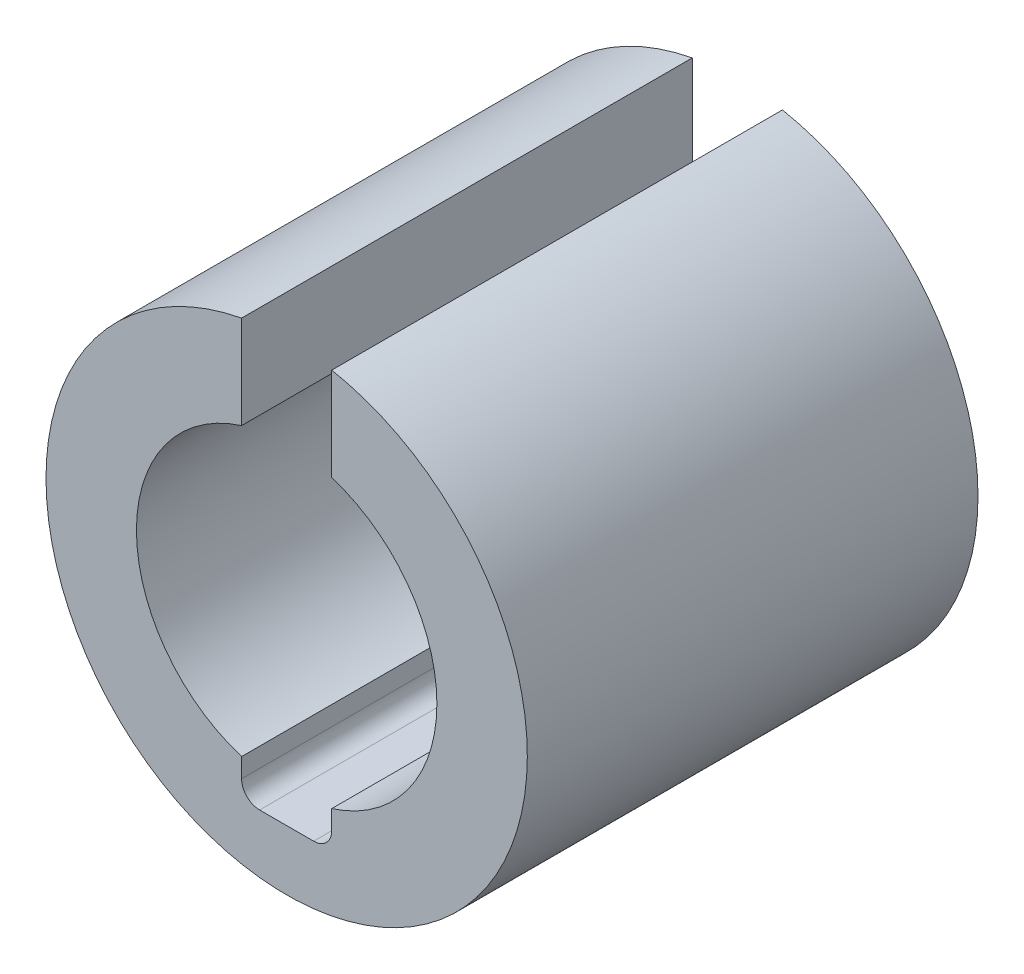
ISO-10303-21;
HEADER;
FILE_DESCRIPTION(('STEP AP214'),'2;1');
FILE_NAME('part.step','',(''),(''),'','','');
FILE_SCHEMA(('AUTOMOTIVE_DESIGN { 1 0 10303 214 1 1 1 1 }'));
ENDSEC;
DATA;
#1=APPLICATION_CONTEXT('core data for automotive mechanical design processes');
#2=APPLICATION_PROTOCOL_DEFINITION('international standard','automotive_design',2000,#1);
#3=PRODUCT_CONTEXT('',#1,'mechanical');
#4=PRODUCT('Part','Part','',(#3));
#5=PRODUCT_RELATED_PRODUCT_CATEGORY('part','',(#4));
#6=PRODUCT_DEFINITION_FORMATION('','',#4);
#7=PRODUCT_DEFINITION_CONTEXT('part definition',#1,'design');
#8=PRODUCT_DEFINITION('design','',#6,#7);
#9=PRODUCT_DEFINITION_SHAPE('','',#8);
#10=(LENGTH_UNIT() NAMED_UNIT(*) SI_UNIT(.MILLI.,.METRE.));
#11=(NAMED_UNIT(*) PLANE_ANGLE_UNIT() SI_UNIT($,.RADIAN.));
#12=(NAMED_UNIT(*) SI_UNIT($,.STERADIAN.) SOLID_ANGLE_UNIT());
#13=UNCERTAINTY_MEASURE_WITH_UNIT(LENGTH_MEASURE(1.E-05),#10,'distance_accuracy_value','');
#14=(GEOMETRIC_REPRESENTATION_CONTEXT(3) GLOBAL_UNCERTAINTY_ASSIGNED_CONTEXT((#13)) GLOBAL_UNIT_ASSIGNED_CONTEXT((#10,
#11,#12)) REPRESENTATION_CONTEXT('',''));
#15=CARTESIAN_POINT('',(0.,0.,0.));
#16=DIRECTION('',(0.,0.,1.));
#17=DIRECTION('',(1.,0.,0.));
#18=AXIS2_PLACEMENT_3D('',#15,#16,#17);
#19=CARTESIAN_POINT('',(-0.750000000000001,-3.005,3.75));
#20=DIRECTION('',(0.,-1.,0.));
#21=DIRECTION('',(0.,0.,-1.));
#22=AXIS2_PLACEMENT_3D('',#19,#20,#21);
#23=PLANE('',#22);
#24=DIRECTION('',(0.,0.,1.));
#25=VECTOR('',#24,1.);
#26=CARTESIAN_POINT('',(-0.450000000000001,-3.005,3.75));
#27=LINE('',#26,#25);
#28=CARTESIAN_POINT('',(-0.450000000000001,-3.005,-3.75));
#29=VERTEX_POINT('',#28);
#30=CARTESIAN_POINT('',(-0.450000000000001,-3.005,3.75));
#31=VERTEX_POINT('',#30);
#32=EDGE_CURVE('E111',#29,#31,#27,.T.);
#33=ORIENTED_EDGE('',*,*,#32,.T.);
#34=DIRECTION('',(1.,0.,0.));
#35=VECTOR('',#34,1.);
#36=CARTESIAN_POINT('',(-0.750000000000001,-3.005,3.75));
#37=LINE('',#36,#35);
#38=CARTESIAN_POINT('',(0.45,-3.005,3.75));
#39=VERTEX_POINT('',#38);
#40=EDGE_CURVE('E127',#39,#31,#37,.F.);
#41=ORIENTED_EDGE('',*,*,#40,.F.);
#42=DIRECTION('',(0.,0.,1.));
#43=VECTOR('',#42,1.);
#44=CARTESIAN_POINT('',(0.45,-3.005,3.75));
#45=LINE('',#44,#43);
#46=CARTESIAN_POINT('',(0.45,-3.005,-3.75));
#47=VERTEX_POINT('',#46);
#48=EDGE_CURVE('E122',#39,#47,#45,.F.);
#49=ORIENTED_EDGE('',*,*,#48,.T.);
#50=DIRECTION('',(1.,0.,0.));
#51=VECTOR('',#50,1.);
#52=CARTESIAN_POINT('',(-0.750000000000001,-3.005,-3.75));
#53=LINE('',#52,#51);
#54=EDGE_CURVE('E112',#29,#47,#53,.T.);
#55=ORIENTED_EDGE('',*,*,#54,.F.);
#56=EDGE_LOOP('',(#33,#41,#49,#55));
#57=FACE_BOUND('',#56,.T.);
#58=ADVANCED_FACE('F17',(#57),#23,.F.);
#59=CARTESIAN_POINT('',(-0.450000000000001,-2.705,3.75));
#60=DIRECTION('',(0.,0.,1.));
#61=DIRECTION('',(1.,0.,0.));
#62=AXIS2_PLACEMENT_3D('',#59,#60,#61);
#63=CYLINDRICAL_SURFACE('',#62,0.3);
#64=ORIENTED_EDGE('',*,*,#32,.F.);
#65=CARTESIAN_POINT('',(-0.450000000000001,-2.705,-3.75));
#66=DIRECTION('',(0.,0.,1.));
#67=DIRECTION('',(1.,0.,0.));
#68=AXIS2_PLACEMENT_3D('',#65,#66,#67);
#69=CIRCLE('',#68,0.3);
#70=CARTESIAN_POINT('',(-0.75,-2.705,-3.75));
#71=VERTEX_POINT('',#70);
#72=EDGE_CURVE('E20',#71,#29,#69,.T.);
#73=ORIENTED_EDGE('',*,*,#72,.F.);
#74=DIRECTION('',(0.,0.,1.));
#75=VECTOR('',#74,1.);
#76=CARTESIAN_POINT('',(-0.750000000000001,-2.705,3.75));
#77=LINE('',#76,#75);
#78=CARTESIAN_POINT('',(-0.75,-2.705,3.75));
#79=VERTEX_POINT('',#78);
#80=EDGE_CURVE('E101',#71,#79,#77,.T.);
#81=ORIENTED_EDGE('',*,*,#80,.T.);
#82=CARTESIAN_POINT('',(-0.450000000000001,-2.705,3.75));
#83=DIRECTION('',(0.,0.,1.));
#84=DIRECTION('',(1.,0.,0.));
#85=AXIS2_PLACEMENT_3D('',#82,#83,#84);
#86=CIRCLE('',#85,0.3);
#87=EDGE_CURVE('E126',#31,#79,#86,.F.);
#88=ORIENTED_EDGE('',*,*,#87,.F.);
#89=EDGE_LOOP('',(#64,#73,#81,#88));
#90=FACE_BOUND('',#89,.T.);
#91=ADVANCED_FACE('F107',(#90),#63,.F.);
#92=CARTESIAN_POINT('',(0.450000000000001,-2.705,3.75));
#93=DIRECTION('',(0.,0.,1.));
#94=DIRECTION('',(1.,0.,0.));
#95=AXIS2_PLACEMENT_3D('',#92,#93,#94);
#96=CYLINDRICAL_SURFACE('',#95,0.3);
#97=DIRECTION('',(0.,0.,1.));
#98=VECTOR('',#97,1.);
#99=CARTESIAN_POINT('',(0.750000000000001,-2.705,3.75));
#100=LINE('',#99,#98);
#101=CARTESIAN_POINT('',(0.75,-2.705,3.75));
#102=VERTEX_POINT('',#101);
#103=CARTESIAN_POINT('',(0.75,-2.705,-3.75));
#104=VERTEX_POINT('',#103);
#105=EDGE_CURVE('E121',#102,#104,#100,.F.);
#106=ORIENTED_EDGE('',*,*,#105,.T.);
#107=CARTESIAN_POINT('',(0.450000000000001,-2.705,-3.75));
#108=DIRECTION('',(0.,0.,1.));
#109=DIRECTION('',(1.,0.,0.));
#110=AXIS2_PLACEMENT_3D('',#107,#108,#109);
#111=CIRCLE('',#110,0.3);
#112=EDGE_CURVE('E125',#47,#104,#111,.T.);
#113=ORIENTED_EDGE('',*,*,#112,.F.);
#114=ORIENTED_EDGE('',*,*,#48,.F.);
#115=CARTESIAN_POINT('',(0.450000000000001,-2.705,3.75));
#116=DIRECTION('',(0.,0.,1.));
#117=DIRECTION('',(1.,0.,0.));
#118=AXIS2_PLACEMENT_3D('',#115,#116,#117);
#119=CIRCLE('',#118,0.3);
#120=EDGE_CURVE('E102',#102,#39,#119,.F.);
#121=ORIENTED_EDGE('',*,*,#120,.F.);
#122=EDGE_LOOP('',(#106,#113,#114,#121));
#123=FACE_BOUND('',#122,.T.);
#124=ADVANCED_FACE('F160',(#123),#96,.F.);
#125=CARTESIAN_POINT('',(-0.750000000000001,-3.005,3.75));
#126=DIRECTION('',(-1.,0.,0.));
#127=DIRECTION('',(0.,-1.,0.));
#128=AXIS2_PLACEMENT_3D('',#125,#126,#127);
#129=PLANE('',#128);
#130=ORIENTED_EDGE('',*,*,#80,.F.);
#131=DIRECTION('',(0.,-1.,0.));
#132=VECTOR('',#131,1.);
#133=CARTESIAN_POINT('',(-0.750000000000001,-3.005,-3.75));
#134=LINE('',#133,#132);
#135=CARTESIAN_POINT('',(-0.75,-2.38484800354236,-3.75));
#136=VERTEX_POINT('',#135);
#137=EDGE_CURVE('E91',#136,#71,#134,.T.);
#138=ORIENTED_EDGE('',*,*,#137,.F.);
#139=DIRECTION('',(0.,0.,-1.));
#140=VECTOR('',#139,1.);
#141=CARTESIAN_POINT('',(-0.75,-2.38484800354236,3.75));
#142=LINE('',#141,#140);
#143=CARTESIAN_POINT('',(-0.75,-2.38484800354236,3.75));
#144=VERTEX_POINT('',#143);
#145=EDGE_CURVE('E173',#136,#144,#142,.F.);
#146=ORIENTED_EDGE('',*,*,#145,.T.);
#147=DIRECTION('',(0.,-1.,0.));
#148=VECTOR('',#147,1.);
#149=CARTESIAN_POINT('',(-0.750000000000001,-3.005,3.75));
#150=LINE('',#149,#148);
#151=EDGE_CURVE('E115',#79,#144,#150,.F.);
#152=ORIENTED_EDGE('',*,*,#151,.F.);
#153=EDGE_LOOP('',(#130,#138,#146,#152));
#154=FACE_BOUND('',#153,.T.);
#155=ADVANCED_FACE('F113',(#154),#129,.F.);
#156=CARTESIAN_POINT('',(0.75,-2.38484800354236,3.75));
#157=DIRECTION('',(1.,0.,0.));
#158=DIRECTION('',(0.,1.,0.));
#159=AXIS2_PLACEMENT_3D('',#156,#157,#158);
#160=PLANE('',#159);
#161=ORIENTED_EDGE('',*,*,#105,.F.);
#162=DIRECTION('',(0.,1.,0.));
#163=VECTOR('',#162,1.);
#164=CARTESIAN_POINT('',(0.75,-2.38484800354236,3.75));
#165=LINE('',#164,#163);
#166=CARTESIAN_POINT('',(0.75,-2.38484800354236,3.75));
#167=VERTEX_POINT('',#166);
#168=EDGE_CURVE('E117',#167,#102,#165,.F.);
#169=ORIENTED_EDGE('',*,*,#168,.F.);
#170=DIRECTION('',(0.,0.,-1.));
#171=VECTOR('',#170,1.);
#172=CARTESIAN_POINT('',(0.750000000000001,-2.38484800354236,3.75));
#173=LINE('',#172,#171);
#174=CARTESIAN_POINT('',(0.75,-2.38484800354236,-3.75));
#175=VERTEX_POINT('',#174);
#176=EDGE_CURVE('E164',#167,#175,#173,.T.);
#177=ORIENTED_EDGE('',*,*,#176,.T.);
#178=DIRECTION('',(0.,1.,0.));
#179=VECTOR('',#178,1.);
#180=CARTESIAN_POINT('',(0.75,-2.38484800354236,-3.75));
#181=LINE('',#180,#179);
#182=EDGE_CURVE('E156',#104,#175,#181,.T.);
#183=ORIENTED_EDGE('',*,*,#182,.F.);
#184=EDGE_LOOP('',(#161,#169,#177,#183));
#185=FACE_BOUND('',#184,.T.);
#186=ADVANCED_FACE('F162',(#185),#160,.F.);
#187=CARTESIAN_POINT('',(0.75,3.9341485737069,3.75));
#188=DIRECTION('',(1.,0.,0.));
#189=DIRECTION('',(0.,1.,0.));
#190=AXIS2_PLACEMENT_3D('',#187,#188,#189);
#191=PLANE('',#190);
#192=DIRECTION('',(0.,0.,-1.));
#193=VECTOR('',#192,1.);
#194=CARTESIAN_POINT('',(0.75,2.38484800354236,3.75));
#195=LINE('',#194,#193);
#196=CARTESIAN_POINT('',(0.75,2.38484800354236,-3.75));
#197=VERTEX_POINT('',#196);
#198=CARTESIAN_POINT('',(0.75,2.38484800354236,3.75));
#199=VERTEX_POINT('',#198);
#200=EDGE_CURVE('E178',#197,#199,#195,.F.);
#201=ORIENTED_EDGE('',*,*,#200,.T.);
#202=DIRECTION('',(0.,1.,0.));
#203=VECTOR('',#202,1.);
#204=CARTESIAN_POINT('',(0.75,3.9341485737069,3.75));
#205=LINE('',#204,#203);
#206=CARTESIAN_POINT('',(0.75,3.9341485737069,3.75));
#207=VERTEX_POINT('',#206);
#208=EDGE_CURVE('E165',#207,#199,#205,.F.);
#209=ORIENTED_EDGE('',*,*,#208,.F.);
#210=DIRECTION('',(0.,0.,-1.));
#211=VECTOR('',#210,1.);
#212=CARTESIAN_POINT('',(0.75,3.9341485737069,3.75));
#213=LINE('',#212,#211);
#214=CARTESIAN_POINT('',(0.75,3.9341485737069,-3.75));
#215=VERTEX_POINT('',#214);
#216=EDGE_CURVE('E144',#215,#207,#213,.F.);
#217=ORIENTED_EDGE('',*,*,#216,.F.);
#218=DIRECTION('',(0.,1.,0.));
#219=VECTOR('',#218,1.);
#220=CARTESIAN_POINT('',(0.75,3.9341485737069,-3.75));
#221=LINE('',#220,#219);
#222=EDGE_CURVE('E35',#197,#215,#221,.T.);
#223=ORIENTED_EDGE('',*,*,#222,.F.);
#224=EDGE_LOOP('',(#201,#209,#217,#223));
#225=FACE_BOUND('',#224,.T.);
#226=ADVANCED_FACE('F194',(#225),#191,.F.);
#227=CARTESIAN_POINT('',(-0.75,2.38484800354236,3.75));
#228=DIRECTION('',(-1.,0.,0.));
#229=DIRECTION('',(0.,-1.,0.));
#230=AXIS2_PLACEMENT_3D('',#227,#228,#229);
#231=PLANE('',#230);
#232=DIRECTION('',(0.,0.,-1.));
#233=VECTOR('',#232,1.);
#234=CARTESIAN_POINT('',(-0.75,3.9341485737069,3.75));
#235=LINE('',#234,#233);
#236=CARTESIAN_POINT('',(-0.75,3.9341485737069,3.75));
#237=VERTEX_POINT('',#236);
#238=CARTESIAN_POINT('',(-0.75,3.9341485737069,-3.75));
#239=VERTEX_POINT('',#238);
#240=EDGE_CURVE('E136',#237,#239,#235,.T.);
#241=ORIENTED_EDGE('',*,*,#240,.F.);
#242=DIRECTION('',(0.,1.,0.));
#243=VECTOR('',#242,1.);
#244=CARTESIAN_POINT('',(-0.75,0.,3.75));
#245=LINE('',#244,#243);
#246=CARTESIAN_POINT('',(-0.75,2.38484800354236,3.75));
#247=VERTEX_POINT('',#246);
#248=EDGE_CURVE('E140',#247,#237,#245,.T.);
#249=ORIENTED_EDGE('',*,*,#248,.F.);
#250=DIRECTION('',(0.,0.,-1.));
#251=VECTOR('',#250,1.);
#252=CARTESIAN_POINT('',(-0.75,2.38484800354236,3.75));
#253=LINE('',#252,#251);
#254=CARTESIAN_POINT('',(-0.75,2.38484800354236,-3.75));
#255=VERTEX_POINT('',#254);
#256=EDGE_CURVE('E175',#247,#255,#253,.T.);
#257=ORIENTED_EDGE('',*,*,#256,.T.);
#258=DIRECTION('',(0.,-1.,0.));
#259=VECTOR('',#258,1.);
#260=CARTESIAN_POINT('',(-0.75,2.38484800354236,-3.75));
#261=LINE('',#260,#259);
#262=EDGE_CURVE('E171',#239,#255,#261,.T.);
#263=ORIENTED_EDGE('',*,*,#262,.F.);
#264=EDGE_LOOP('',(#241,#249,#257,#263));
#265=FACE_BOUND('',#264,.T.);
#266=ADVANCED_FACE('F191',(#265),#231,.F.);
#267=CARTESIAN_POINT('',(0.,0.,3.75));
#268=DIRECTION('',(0.,0.,-1.));
#269=DIRECTION('',(-1.,0.,0.));
#270=AXIS2_PLACEMENT_3D('',#267,#268,#269);
#271=CYLINDRICAL_SURFACE('',#270,2.5);
#272=CARTESIAN_POINT('',(0.,0.,3.75));
#273=DIRECTION('',(0.,0.,-1.));
#274=DIRECTION('',(-1.,0.,0.));
#275=AXIS2_PLACEMENT_3D('',#272,#273,#274);
#276=CIRCLE('',#275,2.5);
#277=EDGE_CURVE('E137',#144,#247,#276,.T.);
#278=ORIENTED_EDGE('',*,*,#277,.F.);
#279=ORIENTED_EDGE('',*,*,#145,.F.);
#280=CARTESIAN_POINT('',(0.,0.,-3.75));
#281=DIRECTION('',(0.,0.,-1.));
#282=DIRECTION('',(-1.,0.,0.));
#283=AXIS2_PLACEMENT_3D('',#280,#281,#282);
#284=CIRCLE('',#283,2.5);
#285=EDGE_CURVE('E96',#136,#255,#284,.T.);
#286=ORIENTED_EDGE('',*,*,#285,.T.);
#287=ORIENTED_EDGE('',*,*,#256,.F.);
#288=EDGE_LOOP('',(#278,#279,#286,#287));
#289=FACE_BOUND('',#288,.T.);
#290=ADVANCED_FACE('F199',(#289),#271,.F.);
#291=CARTESIAN_POINT('',(0.,0.,3.75));
#292=DIRECTION('',(0.,0.,-1.));
#293=DIRECTION('',(-1.,0.,0.));
#294=AXIS2_PLACEMENT_3D('',#291,#292,#293);
#295=CYLINDRICAL_SURFACE('',#294,2.5);
#296=ORIENTED_EDGE('',*,*,#176,.F.);
#297=CARTESIAN_POINT('',(0.,0.,3.75));
#298=DIRECTION('',(0.,0.,-1.));
#299=DIRECTION('',(-1.,0.,0.));
#300=AXIS2_PLACEMENT_3D('',#297,#298,#299);
#301=CIRCLE('',#300,2.5);
#302=EDGE_CURVE('E141',#199,#167,#301,.T.);
#303=ORIENTED_EDGE('',*,*,#302,.F.);
#304=ORIENTED_EDGE('',*,*,#200,.F.);
#305=CARTESIAN_POINT('',(0.,0.,-3.75));
#306=DIRECTION('',(0.,0.,-1.));
#307=DIRECTION('',(-1.,0.,0.));
#308=AXIS2_PLACEMENT_3D('',#305,#306,#307);
#309=CIRCLE('',#308,2.5);
#310=EDGE_CURVE('E132',#197,#175,#309,.T.);
#311=ORIENTED_EDGE('',*,*,#310,.T.);
#312=EDGE_LOOP('',(#296,#303,#304,#311));
#313=FACE_BOUND('',#312,.T.);
#314=ADVANCED_FACE('F197',(#313),#295,.F.);
#315=CARTESIAN_POINT('',(0.,0.,3.75));
#316=DIRECTION('',(0.,0.,1.));
#317=DIRECTION('',(1.,0.,0.));
#318=AXIS2_PLACEMENT_3D('',#315,#316,#317);
#319=PLANE('',#318);
#320=CARTESIAN_POINT('',(0.,0.,3.75));
#321=DIRECTION('',(0.,0.,-1.));
#322=DIRECTION('',(-1.,0.,0.));
#323=AXIS2_PLACEMENT_3D('',#320,#321,#322);
#324=CIRCLE('',#323,4.005);
#325=EDGE_CURVE('E26',#207,#237,#324,.T.);
#326=ORIENTED_EDGE('',*,*,#325,.F.);
#327=ORIENTED_EDGE('',*,*,#208,.T.);
#328=ORIENTED_EDGE('',*,*,#302,.T.);
#329=ORIENTED_EDGE('',*,*,#168,.T.);
#330=ORIENTED_EDGE('',*,*,#120,.T.);
#331=ORIENTED_EDGE('',*,*,#40,.T.);
#332=ORIENTED_EDGE('',*,*,#87,.T.);
#333=ORIENTED_EDGE('',*,*,#151,.T.);
#334=ORIENTED_EDGE('',*,*,#277,.T.);
#335=ORIENTED_EDGE('',*,*,#248,.T.);
#336=EDGE_LOOP('',(#326,#327,#328,#329,#330,#331,#332,#333,#334,#335));
#337=FACE_BOUND('',#336,.T.);
#338=ADVANCED_FACE('F148',(#337),#319,.T.);
#339=CARTESIAN_POINT('',(0.,0.,-3.75));
#340=DIRECTION('',(0.,0.,1.));
#341=DIRECTION('',(1.,0.,0.));
#342=AXIS2_PLACEMENT_3D('',#339,#340,#341);
#343=PLANE('',#342);
#344=ORIENTED_EDGE('',*,*,#222,.T.);
#345=CARTESIAN_POINT('',(0.,0.,-3.75));
#346=DIRECTION('',(0.,0.,-1.));
#347=DIRECTION('',(-1.,0.,0.));
#348=AXIS2_PLACEMENT_3D('',#345,#346,#347);
#349=CIRCLE('',#348,4.005);
#350=EDGE_CURVE('E11',#239,#215,#349,.F.);
#351=ORIENTED_EDGE('',*,*,#350,.F.);
#352=ORIENTED_EDGE('',*,*,#262,.T.);
#353=ORIENTED_EDGE('',*,*,#285,.F.);
#354=ORIENTED_EDGE('',*,*,#137,.T.);
#355=ORIENTED_EDGE('',*,*,#72,.T.);
#356=ORIENTED_EDGE('',*,*,#54,.T.);
#357=ORIENTED_EDGE('',*,*,#112,.T.);
#358=ORIENTED_EDGE('',*,*,#182,.T.);
#359=ORIENTED_EDGE('',*,*,#310,.F.);
#360=EDGE_LOOP('',(#344,#351,#352,#353,#354,#355,#356,#357,#358,#359));
#361=FACE_BOUND('',#360,.T.);
#362=ADVANCED_FACE('F93',(#361),#343,.F.);
#363=CARTESIAN_POINT('',(0.,0.,3.75));
#364=DIRECTION('',(0.,0.,-1.));
#365=DIRECTION('',(-1.,0.,0.));
#366=AXIS2_PLACEMENT_3D('',#363,#364,#365);
#367=CYLINDRICAL_SURFACE('',#366,4.005);
#368=ORIENTED_EDGE('',*,*,#325,.T.);
#369=ORIENTED_EDGE('',*,*,#240,.T.);
#370=ORIENTED_EDGE('',*,*,#350,.T.);
#371=ORIENTED_EDGE('',*,*,#216,.T.);
#372=EDGE_LOOP('',(#368,#369,#370,#371));
#373=FACE_BOUND('',#372,.T.);
#374=ADVANCED_FACE('F193',(#373),#367,.T.);
#375=CLOSED_SHELL('',(#58,#91,#124,#155,#186,#226,#266,#290,#314,#338,#362,#374));
#376=MANIFOLD_SOLID_BREP('B1',#375);
#377=ADVANCED_BREP_SHAPE_REPRESENTATION('',(#18,#376),#14);
#378=SHAPE_DEFINITION_REPRESENTATION(#9,#377);
ENDSEC;
END-ISO-10303-21;
